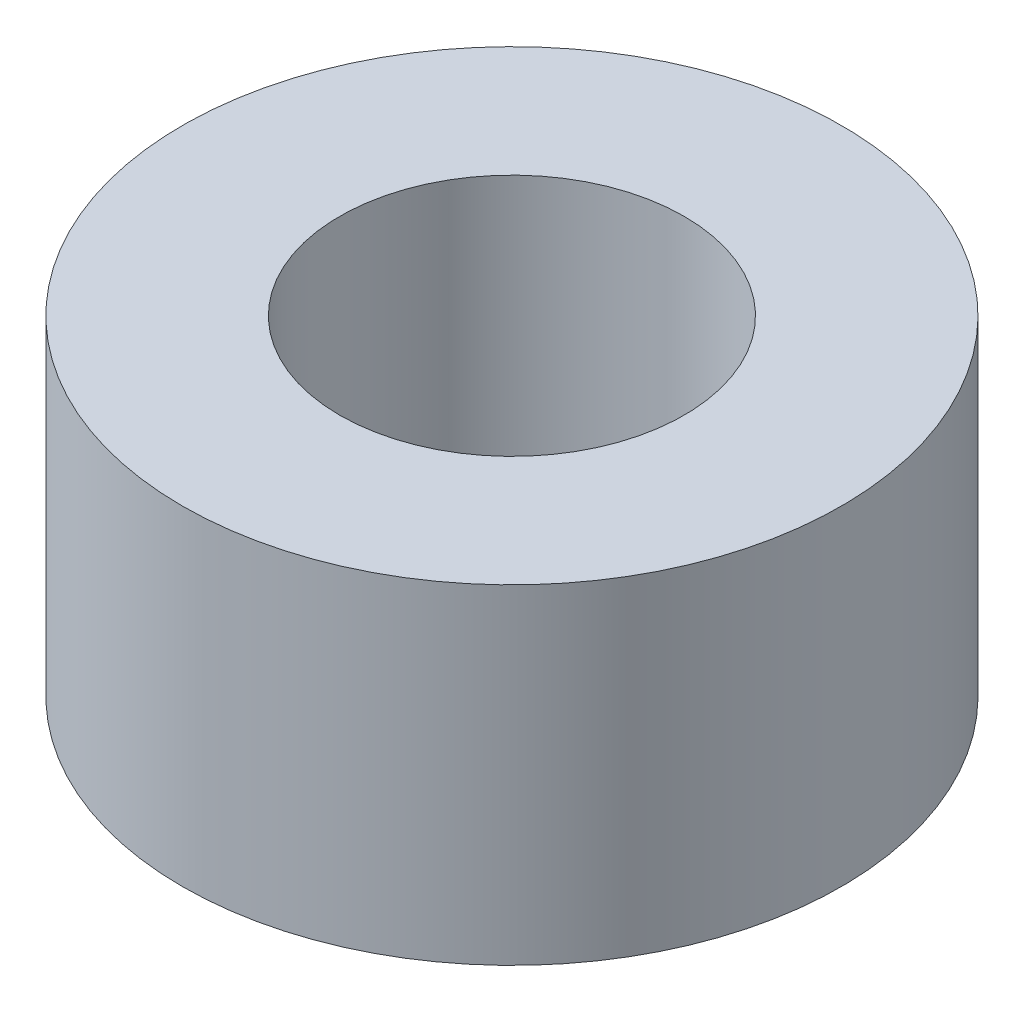
ISO-10303-21;
HEADER;
FILE_DESCRIPTION(('STEP AP214'),'2;1');
FILE_NAME('part.step','',(''),(''),'','','');
FILE_SCHEMA(('AUTOMOTIVE_DESIGN { 1 0 10303 214 1 1 1 1 }'));
ENDSEC;
DATA;
#1=APPLICATION_CONTEXT('core data for automotive mechanical design processes');
#2=APPLICATION_PROTOCOL_DEFINITION('international standard','automotive_design',2000,#1);
#3=PRODUCT_CONTEXT('',#1,'mechanical');
#4=PRODUCT('Part','Part','',(#3));
#5=PRODUCT_RELATED_PRODUCT_CATEGORY('part','',(#4));
#6=PRODUCT_DEFINITION_FORMATION('','',#4);
#7=PRODUCT_DEFINITION_CONTEXT('part definition',#1,'design');
#8=PRODUCT_DEFINITION('design','',#6,#7);
#9=PRODUCT_DEFINITION_SHAPE('','',#8);
#10=(LENGTH_UNIT() NAMED_UNIT(*) SI_UNIT(.MILLI.,.METRE.));
#11=(NAMED_UNIT(*) PLANE_ANGLE_UNIT() SI_UNIT($,.RADIAN.));
#12=(NAMED_UNIT(*) SI_UNIT($,.STERADIAN.) SOLID_ANGLE_UNIT());
#13=UNCERTAINTY_MEASURE_WITH_UNIT(LENGTH_MEASURE(1.E-05),#10,'distance_accuracy_value','');
#14=(GEOMETRIC_REPRESENTATION_CONTEXT(3) GLOBAL_UNCERTAINTY_ASSIGNED_CONTEXT((#13)) GLOBAL_UNIT_ASSIGNED_CONTEXT((#10,
#11,#12)) REPRESENTATION_CONTEXT('',''));
#15=CARTESIAN_POINT('',(0.,0.,0.));
#16=DIRECTION('',(0.,0.,1.));
#17=DIRECTION('',(1.,0.,0.));
#18=AXIS2_PLACEMENT_3D('',#15,#16,#17);
#19=CARTESIAN_POINT('',(0.,4.7625,0.));
#20=DIRECTION('',(0.,1.,0.));
#21=DIRECTION('',(0.,0.,1.));
#22=AXIS2_PLACEMENT_3D('',#19,#20,#21);
#23=PLANE('',#22);
#24=CARTESIAN_POINT('',(0.,4.7625,0.));
#25=DIRECTION('',(0.,1.,0.));
#26=DIRECTION('',(0.,0.,1.));
#27=AXIS2_PLACEMENT_3D('',#24,#25,#26);
#28=CIRCLE('',#27,4.7625);
#29=CARTESIAN_POINT('',(0.,4.7625,4.7625));
#30=VERTEX_POINT('',#29);
#31=EDGE_CURVE('E10',#30,#30,#28,.T.);
#32=ORIENTED_EDGE('',*,*,#31,.T.);
#33=EDGE_LOOP('',(#32));
#34=FACE_BOUND('',#33,.T.);
#35=CARTESIAN_POINT('',(0.,4.7625,0.));
#36=DIRECTION('',(0.,1.,0.));
#37=DIRECTION('',(0.,0.,1.));
#38=AXIS2_PLACEMENT_3D('',#35,#36,#37);
#39=CIRCLE('',#38,2.4892);
#40=CARTESIAN_POINT('',(0.,4.7625,2.4892));
#41=VERTEX_POINT('',#40);
#42=EDGE_CURVE('E42',#41,#41,#39,.T.);
#43=ORIENTED_EDGE('',*,*,#42,.F.);
#44=EDGE_LOOP('',(#43));
#45=FACE_BOUND('',#44,.T.);
#46=ADVANCED_FACE('F31',(#34,#45),#23,.T.);
#47=CARTESIAN_POINT('',(0.,0.,0.));
#48=DIRECTION('',(0.,1.,0.));
#49=DIRECTION('',(0.,0.,1.));
#50=AXIS2_PLACEMENT_3D('',#47,#48,#49);
#51=PLANE('',#50);
#52=CARTESIAN_POINT('',(0.,0.,0.));
#53=DIRECTION('',(0.,1.,0.));
#54=DIRECTION('',(0.,0.,1.));
#55=AXIS2_PLACEMENT_3D('',#52,#53,#54);
#56=CIRCLE('',#55,4.7625);
#57=CARTESIAN_POINT('',(0.,0.,4.7625));
#58=VERTEX_POINT('',#57);
#59=EDGE_CURVE('E35',#58,#58,#56,.T.);
#60=ORIENTED_EDGE('',*,*,#59,.F.);
#61=EDGE_LOOP('',(#60));
#62=FACE_BOUND('',#61,.T.);
#63=CARTESIAN_POINT('',(0.,0.,0.));
#64=DIRECTION('',(0.,1.,0.));
#65=DIRECTION('',(0.,0.,1.));
#66=AXIS2_PLACEMENT_3D('',#63,#64,#65);
#67=CIRCLE('',#66,2.4892);
#68=CARTESIAN_POINT('',(0.,0.,2.4892));
#69=VERTEX_POINT('',#68);
#70=EDGE_CURVE('E44',#69,#69,#67,.T.);
#71=ORIENTED_EDGE('',*,*,#70,.T.);
#72=EDGE_LOOP('',(#71));
#73=FACE_BOUND('',#72,.T.);
#74=ADVANCED_FACE('F54',(#62,#73),#51,.F.);
#75=CARTESIAN_POINT('',(0.,4.7625,0.));
#76=DIRECTION('',(0.,-1.,0.));
#77=DIRECTION('',(0.,0.,-1.));
#78=AXIS2_PLACEMENT_3D('',#75,#76,#77);
#79=CYLINDRICAL_SURFACE('',#78,4.7625);
#80=ORIENTED_EDGE('',*,*,#31,.F.);
#81=EDGE_LOOP('',(#80));
#82=FACE_BOUND('',#81,.T.);
#83=ORIENTED_EDGE('',*,*,#59,.T.);
#84=EDGE_LOOP('',(#83));
#85=FACE_BOUND('',#84,.T.);
#86=ADVANCED_FACE('F33',(#82,#85),#79,.T.);
#87=CARTESIAN_POINT('',(0.,4.7625,0.));
#88=DIRECTION('',(0.,-1.,0.));
#89=DIRECTION('',(0.,0.,-1.));
#90=AXIS2_PLACEMENT_3D('',#87,#88,#89);
#91=CYLINDRICAL_SURFACE('',#90,2.4892);
#92=ORIENTED_EDGE('',*,*,#42,.T.);
#93=EDGE_LOOP('',(#92));
#94=FACE_BOUND('',#93,.T.);
#95=ORIENTED_EDGE('',*,*,#70,.F.);
#96=EDGE_LOOP('',(#95));
#97=FACE_BOUND('',#96,.T.);
#98=ADVANCED_FACE('F50',(#94,#97),#91,.F.);
#99=CLOSED_SHELL('',(#46,#74,#86,#98));
#100=MANIFOLD_SOLID_BREP('B2',#99);
#101=ADVANCED_BREP_SHAPE_REPRESENTATION('',(#18,#100),#14);
#102=SHAPE_DEFINITION_REPRESENTATION(#9,#101);
ENDSEC;
END-ISO-10303-21;
